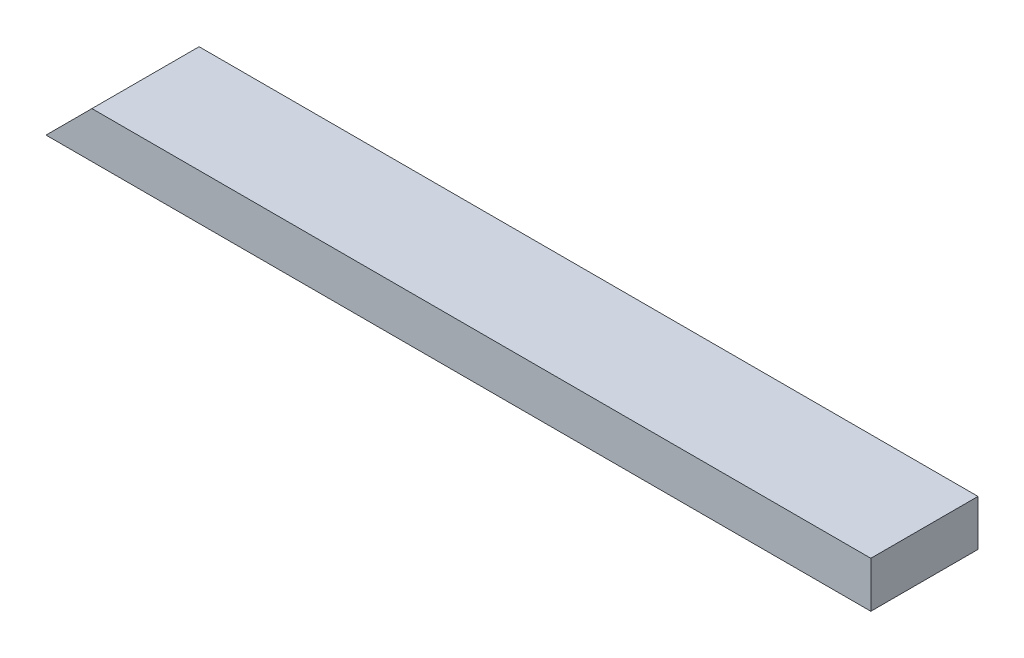
ISO-10303-21;
HEADER;
FILE_DESCRIPTION(('STEP AP214'),'2;1');
FILE_NAME('part.step','',(''),(''),'','','');
FILE_SCHEMA(('AUTOMOTIVE_DESIGN { 1 0 10303 214 1 1 1 1 }'));
ENDSEC;
DATA;
#1=APPLICATION_CONTEXT('core data for automotive mechanical design processes');
#2=APPLICATION_PROTOCOL_DEFINITION('international standard','automotive_design',2000,#1);
#3=PRODUCT_CONTEXT('',#1,'mechanical');
#4=PRODUCT('Part','Part','',(#3));
#5=PRODUCT_RELATED_PRODUCT_CATEGORY('part','',(#4));
#6=PRODUCT_DEFINITION_FORMATION('','',#4);
#7=PRODUCT_DEFINITION_CONTEXT('part definition',#1,'design');
#8=PRODUCT_DEFINITION('design','',#6,#7);
#9=PRODUCT_DEFINITION_SHAPE('','',#8);
#10=(LENGTH_UNIT() NAMED_UNIT(*) SI_UNIT(.MILLI.,.METRE.));
#11=(NAMED_UNIT(*) PLANE_ANGLE_UNIT() SI_UNIT($,.RADIAN.));
#12=(NAMED_UNIT(*) SI_UNIT($,.STERADIAN.) SOLID_ANGLE_UNIT());
#13=UNCERTAINTY_MEASURE_WITH_UNIT(LENGTH_MEASURE(1.E-05),#10,'distance_accuracy_value','');
#14=(GEOMETRIC_REPRESENTATION_CONTEXT(3) GLOBAL_UNCERTAINTY_ASSIGNED_CONTEXT((#13)) GLOBAL_UNIT_ASSIGNED_CONTEXT((#10,
#11,#12)) REPRESENTATION_CONTEXT('',''));
#15=CARTESIAN_POINT('',(0.,0.,0.));
#16=DIRECTION('',(0.,0.,1.));
#17=DIRECTION('',(1.,0.,0.));
#18=AXIS2_PLACEMENT_3D('',#15,#16,#17);
#19=CARTESIAN_POINT('',(0.,38.1,0.));
#20=DIRECTION('',(0.,0.,-1.));
#21=DIRECTION('',(-1.,0.,0.));
#22=AXIS2_PLACEMENT_3D('',#19,#20,#21);
#23=PLANE('',#22);
#24=DIRECTION('',(1.,0.,0.));
#25=VECTOR('',#24,1.);
#26=CARTESIAN_POINT('',(0.,38.1,0.));
#27=LINE('',#26,#25);
#28=CARTESIAN_POINT('',(38.1,38.1,0.));
#29=VERTEX_POINT('',#28);
#30=CARTESIAN_POINT('',(684.24425,38.1,0.));
#31=VERTEX_POINT('',#30);
#32=EDGE_CURVE('E92',#29,#31,#27,.T.);
#33=ORIENTED_EDGE('',*,*,#32,.F.);
#34=DIRECTION('',(0.707106781186547,0.707106781186547,0.));
#35=VECTOR('',#34,1.);
#36=CARTESIAN_POINT('',(0.,0.,0.));
#37=LINE('',#36,#35);
#38=CARTESIAN_POINT('',(0.,0.,0.));
#39=VERTEX_POINT('',#38);
#40=EDGE_CURVE('E86',#39,#29,#37,.T.);
#41=ORIENTED_EDGE('',*,*,#40,.F.);
#42=DIRECTION('',(1.,0.,0.));
#43=VECTOR('',#42,1.);
#44=CARTESIAN_POINT('',(0.,0.,0.));
#45=LINE('',#44,#43);
#46=CARTESIAN_POINT('',(684.24425,0.,0.));
#47=VERTEX_POINT('',#46);
#48=EDGE_CURVE('E96',#39,#47,#45,.T.);
#49=ORIENTED_EDGE('',*,*,#48,.T.);
#50=DIRECTION('',(0.,-1.,0.));
#51=VECTOR('',#50,1.);
#52=CARTESIAN_POINT('',(684.24425,38.1,0.));
#53=LINE('',#52,#51);
#54=EDGE_CURVE('E11',#31,#47,#53,.T.);
#55=ORIENTED_EDGE('',*,*,#54,.F.);
#56=EDGE_LOOP('',(#33,#41,#49,#55));
#57=FACE_BOUND('',#56,.T.);
#58=ADVANCED_FACE('F39',(#57),#23,.F.);
#59=CARTESIAN_POINT('',(684.24425,38.1,0.));
#60=DIRECTION('',(-1.,0.,0.));
#61=DIRECTION('',(0.,0.,1.));
#62=AXIS2_PLACEMENT_3D('',#59,#60,#61);
#63=PLANE('',#62);
#64=DIRECTION('',(0.,0.,-1.));
#65=VECTOR('',#64,1.);
#66=CARTESIAN_POINT('',(684.24425,0.,0.));
#67=LINE('',#66,#65);
#68=CARTESIAN_POINT('',(684.24425,0.,-88.9));
#69=VERTEX_POINT('',#68);
#70=EDGE_CURVE('E67',#47,#69,#67,.T.);
#71=ORIENTED_EDGE('',*,*,#70,.T.);
#72=DIRECTION('',(0.,-1.,0.));
#73=VECTOR('',#72,1.);
#74=CARTESIAN_POINT('',(684.24425,38.1,-88.9));
#75=LINE('',#74,#73);
#76=CARTESIAN_POINT('',(684.24425,38.1,-88.9));
#77=VERTEX_POINT('',#76);
#78=EDGE_CURVE('E47',#77,#69,#75,.T.);
#79=ORIENTED_EDGE('',*,*,#78,.F.);
#80=DIRECTION('',(0.,0.,-1.));
#81=VECTOR('',#80,1.);
#82=CARTESIAN_POINT('',(684.24425,38.1,0.));
#83=LINE('',#82,#81);
#84=EDGE_CURVE('E55',#31,#77,#83,.T.);
#85=ORIENTED_EDGE('',*,*,#84,.F.);
#86=ORIENTED_EDGE('',*,*,#54,.T.);
#87=EDGE_LOOP('',(#71,#79,#85,#86));
#88=FACE_BOUND('',#87,.T.);
#89=ADVANCED_FACE('F111',(#88),#63,.F.);
#90=CARTESIAN_POINT('',(0.,38.1,-88.9));
#91=DIRECTION('',(0.,0.,1.));
#92=DIRECTION('',(1.,0.,0.));
#93=AXIS2_PLACEMENT_3D('',#90,#91,#92);
#94=PLANE('',#93);
#95=DIRECTION('',(-1.,0.,0.));
#96=VECTOR('',#95,1.);
#97=CARTESIAN_POINT('',(0.,0.,-88.9));
#98=LINE('',#97,#96);
#99=CARTESIAN_POINT('',(0.,0.,-88.9));
#100=VERTEX_POINT('',#99);
#101=EDGE_CURVE('E89',#69,#100,#98,.T.);
#102=ORIENTED_EDGE('',*,*,#101,.T.);
#103=DIRECTION('',(0.707106781186547,0.707106781186547,0.));
#104=VECTOR('',#103,1.);
#105=CARTESIAN_POINT('',(0.,0.,-88.9));
#106=LINE('',#105,#104);
#107=CARTESIAN_POINT('',(38.1,38.1,-88.9));
#108=VERTEX_POINT('',#107);
#109=EDGE_CURVE('E74',#100,#108,#106,.T.);
#110=ORIENTED_EDGE('',*,*,#109,.T.);
#111=DIRECTION('',(-1.,0.,0.));
#112=VECTOR('',#111,1.);
#113=CARTESIAN_POINT('',(0.,38.1,-88.9));
#114=LINE('',#113,#112);
#115=EDGE_CURVE('E101',#77,#108,#114,.T.);
#116=ORIENTED_EDGE('',*,*,#115,.F.);
#117=ORIENTED_EDGE('',*,*,#78,.T.);
#118=EDGE_LOOP('',(#102,#110,#116,#117));
#119=FACE_BOUND('',#118,.T.);
#120=ADVANCED_FACE('F90',(#119),#94,.F.);
#121=CARTESIAN_POINT('',(0.,38.1,0.));
#122=DIRECTION('',(0.,-1.,0.));
#123=DIRECTION('',(0.,0.,-1.));
#124=AXIS2_PLACEMENT_3D('',#121,#122,#123);
#125=PLANE('',#124);
#126=ORIENTED_EDGE('',*,*,#115,.T.);
#127=DIRECTION('',(0.,0.,1.));
#128=VECTOR('',#127,1.);
#129=CARTESIAN_POINT('',(38.1,38.1,-88.9));
#130=LINE('',#129,#128);
#131=EDGE_CURVE('E83',#108,#29,#130,.T.);
#132=ORIENTED_EDGE('',*,*,#131,.T.);
#133=ORIENTED_EDGE('',*,*,#32,.T.);
#134=ORIENTED_EDGE('',*,*,#84,.T.);
#135=EDGE_LOOP('',(#126,#132,#133,#134));
#136=FACE_BOUND('',#135,.T.);
#137=ADVANCED_FACE('F109',(#136),#125,.F.);
#138=CARTESIAN_POINT('',(0.,0.,0.));
#139=DIRECTION('',(0.,-1.,0.));
#140=DIRECTION('',(0.,0.,-1.));
#141=AXIS2_PLACEMENT_3D('',#138,#139,#140);
#142=PLANE('',#141);
#143=DIRECTION('',(0.,0.,1.));
#144=VECTOR('',#143,1.);
#145=CARTESIAN_POINT('',(0.,0.,0.));
#146=LINE('',#145,#144);
#147=EDGE_CURVE('E80',#100,#39,#146,.T.);
#148=ORIENTED_EDGE('',*,*,#147,.F.);
#149=ORIENTED_EDGE('',*,*,#101,.F.);
#150=ORIENTED_EDGE('',*,*,#70,.F.);
#151=ORIENTED_EDGE('',*,*,#48,.F.);
#152=EDGE_LOOP('',(#148,#149,#150,#151));
#153=FACE_BOUND('',#152,.T.);
#154=ADVANCED_FACE('F95',(#153),#142,.T.);
#155=CARTESIAN_POINT('',(0.,0.,-88.9));
#156=DIRECTION('',(0.707106781186547,-0.707106781186547,0.));
#157=DIRECTION('',(0.707106781186548,0.707106781186548,0.));
#158=AXIS2_PLACEMENT_3D('',#155,#156,#157);
#159=PLANE('',#158);
#160=ORIENTED_EDGE('',*,*,#40,.T.);
#161=ORIENTED_EDGE('',*,*,#131,.F.);
#162=ORIENTED_EDGE('',*,*,#109,.F.);
#163=ORIENTED_EDGE('',*,*,#147,.T.);
#164=EDGE_LOOP('',(#160,#161,#162,#163));
#165=FACE_BOUND('',#164,.T.);
#166=ADVANCED_FACE('F77',(#165),#159,.F.);
#167=CLOSED_SHELL('',(#58,#89,#120,#137,#154,#166));
#168=MANIFOLD_SOLID_BREP('B2',#167);
#169=ADVANCED_BREP_SHAPE_REPRESENTATION('',(#18,#168),#14);
#170=SHAPE_DEFINITION_REPRESENTATION(#9,#169);
ENDSEC;
END-ISO-10303-21;
